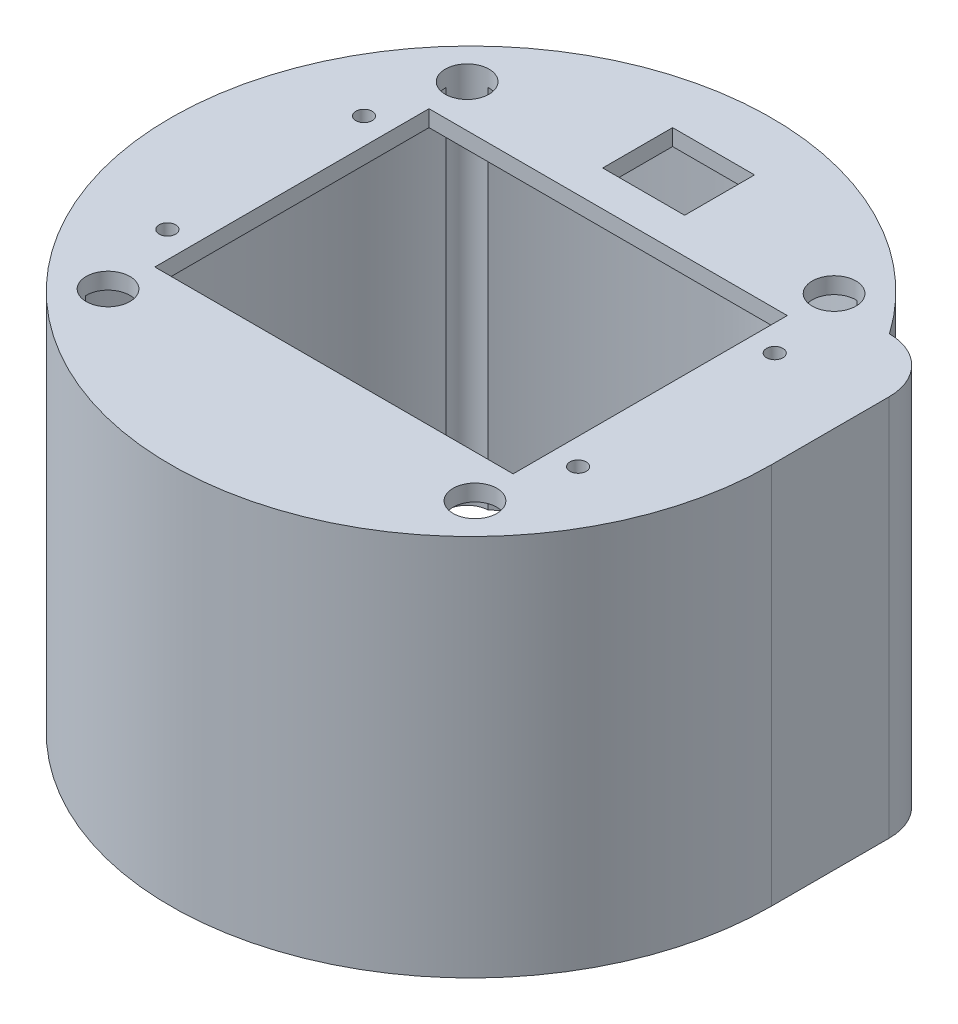
ISO-10303-21;
HEADER;
FILE_DESCRIPTION(('STEP AP214'),'2;1');
FILE_NAME('part.step','',(''),(''),'','','');
FILE_SCHEMA(('AUTOMOTIVE_DESIGN { 1 0 10303 214 1 1 1 1 }'));
ENDSEC;
DATA;
#1=APPLICATION_CONTEXT('core data for automotive mechanical design processes');
#2=APPLICATION_PROTOCOL_DEFINITION('international standard','automotive_design',2000,#1);
#3=PRODUCT_CONTEXT('',#1,'mechanical');
#4=PRODUCT('Part','Part','',(#3));
#5=PRODUCT_RELATED_PRODUCT_CATEGORY('part','',(#4));
#6=PRODUCT_DEFINITION_FORMATION('','',#4);
#7=PRODUCT_DEFINITION_CONTEXT('part definition',#1,'design');
#8=PRODUCT_DEFINITION('design','',#6,#7);
#9=PRODUCT_DEFINITION_SHAPE('','',#8);
#10=(LENGTH_UNIT() NAMED_UNIT(*) SI_UNIT(.MILLI.,.METRE.));
#11=(NAMED_UNIT(*) PLANE_ANGLE_UNIT() SI_UNIT($,.RADIAN.));
#12=(NAMED_UNIT(*) SI_UNIT($,.STERADIAN.) SOLID_ANGLE_UNIT());
#13=UNCERTAINTY_MEASURE_WITH_UNIT(LENGTH_MEASURE(1.E-05),#10,'distance_accuracy_value','');
#14=(GEOMETRIC_REPRESENTATION_CONTEXT(3) GLOBAL_UNCERTAINTY_ASSIGNED_CONTEXT((#13)) GLOBAL_UNIT_ASSIGNED_CONTEXT((#10,
#11,#12)) REPRESENTATION_CONTEXT('',''));
#15=CARTESIAN_POINT('',(0.,0.,0.));
#16=DIRECTION('',(0.,0.,1.));
#17=DIRECTION('',(1.,0.,0.));
#18=AXIS2_PLACEMENT_3D('',#15,#16,#17);
#19=CARTESIAN_POINT('',(0.,70.,0.));
#20=DIRECTION('',(0.,-1.,0.));
#21=DIRECTION('',(0.,0.,-1.));
#22=AXIS2_PLACEMENT_3D('',#19,#20,#21);
#23=CYLINDRICAL_SURFACE('',#22,55.);
#24=DIRECTION('',(0.,-1.,0.));
#25=VECTOR('',#24,1.);
#26=CARTESIAN_POINT('',(55.,101.530905994305,-2.09390455113722E-13));
#27=LINE('',#26,#25);
#28=CARTESIAN_POINT('',(55.,70.,-2.09390455113722E-13));
#29=VERTEX_POINT('',#28);
#30=CARTESIAN_POINT('',(55.,0.,-2.09390455113722E-13));
#31=VERTEX_POINT('',#30);
#32=EDGE_CURVE('E233',#29,#31,#27,.T.);
#33=ORIENTED_EDGE('',*,*,#32,.F.);
#34=CARTESIAN_POINT('',(0.,70.,0.));
#35=DIRECTION('',(0.,1.,0.));
#36=DIRECTION('',(0.,0.,1.));
#37=AXIS2_PLACEMENT_3D('',#34,#35,#36);
#38=CIRCLE('',#37,55.);
#39=CARTESIAN_POINT('',(45.0533624358946,70.,-31.5467039993074));
#40=VERTEX_POINT('',#39);
#41=EDGE_CURVE('E357',#40,#29,#38,.T.);
#42=ORIENTED_EDGE('',*,*,#41,.F.);
#43=DIRECTION('',(0.,-1.,0.));
#44=VECTOR('',#43,1.);
#45=CARTESIAN_POINT('',(45.0533624358946,101.530905994305,-31.5467039993074));
#46=LINE('',#45,#44);
#47=CARTESIAN_POINT('',(45.0533624358946,0.,-31.5467039993074));
#48=VERTEX_POINT('',#47);
#49=EDGE_CURVE('E240',#40,#48,#46,.T.);
#50=ORIENTED_EDGE('',*,*,#49,.T.);
#51=CARTESIAN_POINT('',(0.,0.,0.));
#52=DIRECTION('',(0.,1.,0.));
#53=DIRECTION('',(0.,0.,1.));
#54=AXIS2_PLACEMENT_3D('',#51,#52,#53);
#55=CIRCLE('',#54,55.);
#56=EDGE_CURVE('E350',#48,#31,#55,.T.);
#57=ORIENTED_EDGE('',*,*,#56,.T.);
#58=EDGE_LOOP('',(#33,#42,#50,#57));
#59=FACE_BOUND('',#58,.T.);
#60=ADVANCED_FACE('F34',(#59),#23,.T.);
#61=CARTESIAN_POINT('',(0.,67.,0.));
#62=DIRECTION('',(0.,-1.,0.));
#63=DIRECTION('',(0.,0.,-1.));
#64=AXIS2_PLACEMENT_3D('',#61,#62,#63);
#65=PLANE('',#64);
#66=DIRECTION('',(0.,0.,-1.));
#67=VECTOR('',#66,1.);
#68=CARTESIAN_POINT('',(-7.49999999999999,67.,0.));
#69=LINE('',#68,#67);
#70=CARTESIAN_POINT('',(-7.5,67.,-31.6));
#71=VERTEX_POINT('',#70);
#72=CARTESIAN_POINT('',(-7.5,67.,-44.4));
#73=VERTEX_POINT('',#72);
#74=EDGE_CURVE('E221',#71,#73,#69,.T.);
#75=ORIENTED_EDGE('',*,*,#74,.F.);
#76=DIRECTION('',(-1.,0.,0.));
#77=VECTOR('',#76,1.);
#78=CARTESIAN_POINT('',(0.,67.,-31.6));
#79=LINE('',#78,#77);
#80=CARTESIAN_POINT('',(7.5,67.,-31.6));
#81=VERTEX_POINT('',#80);
#82=EDGE_CURVE('E214',#81,#71,#79,.T.);
#83=ORIENTED_EDGE('',*,*,#82,.F.);
#84=DIRECTION('',(0.,0.,1.));
#85=VECTOR('',#84,1.);
#86=CARTESIAN_POINT('',(7.50000000000001,67.,0.));
#87=LINE('',#86,#85);
#88=CARTESIAN_POINT('',(7.5,67.,-44.4));
#89=VERTEX_POINT('',#88);
#90=EDGE_CURVE('E194',#89,#81,#87,.T.);
#91=ORIENTED_EDGE('',*,*,#90,.F.);
#92=DIRECTION('',(1.,0.,0.));
#93=VECTOR('',#92,1.);
#94=CARTESIAN_POINT('',(0.,67.,-44.4));
#95=LINE('',#94,#93);
#96=EDGE_CURVE('E219',#73,#89,#95,.T.);
#97=ORIENTED_EDGE('',*,*,#96,.F.);
#98=EDGE_LOOP('',(#75,#83,#91,#97));
#99=FACE_BOUND('',#98,.T.);
#100=CARTESIAN_POINT('',(-37.6,67.,18.));
#101=DIRECTION('',(0.,-1.,0.));
#102=DIRECTION('',(0.,0.,-1.));
#103=AXIS2_PLACEMENT_3D('',#100,#101,#102);
#104=CIRCLE('',#103,1.5);
#105=CARTESIAN_POINT('',(-37.6,67.,16.5));
#106=VERTEX_POINT('',#105);
#107=EDGE_CURVE('E265',#106,#106,#104,.T.);
#108=ORIENTED_EDGE('',*,*,#107,.F.);
#109=EDGE_LOOP('',(#108));
#110=FACE_BOUND('',#109,.T.);
#111=CARTESIAN_POINT('',(37.6,67.,-18.));
#112=DIRECTION('',(0.,-1.,0.));
#113=DIRECTION('',(0.,0.,-1.));
#114=AXIS2_PLACEMENT_3D('',#111,#112,#113);
#115=CIRCLE('',#114,1.5);
#116=CARTESIAN_POINT('',(37.6,67.,-19.5));
#117=VERTEX_POINT('',#116);
#118=EDGE_CURVE('E375',#117,#117,#115,.T.);
#119=ORIENTED_EDGE('',*,*,#118,.F.);
#120=EDGE_LOOP('',(#119));
#121=FACE_BOUND('',#120,.T.);
#122=CARTESIAN_POINT('',(37.6,67.,18.));
#123=DIRECTION('',(0.,-1.,0.));
#124=DIRECTION('',(0.,0.,-1.));
#125=AXIS2_PLACEMENT_3D('',#122,#123,#124);
#126=CIRCLE('',#125,1.5);
#127=CARTESIAN_POINT('',(37.6,67.,16.5));
#128=VERTEX_POINT('',#127);
#129=EDGE_CURVE('E255',#128,#128,#126,.T.);
#130=ORIENTED_EDGE('',*,*,#129,.F.);
#131=EDGE_LOOP('',(#130));
#132=FACE_BOUND('',#131,.T.);
#133=CARTESIAN_POINT('',(-37.6,67.,-18.));
#134=DIRECTION('',(0.,-1.,0.));
#135=DIRECTION('',(0.,0.,-1.));
#136=AXIS2_PLACEMENT_3D('',#133,#134,#135);
#137=CIRCLE('',#136,1.5);
#138=CARTESIAN_POINT('',(-37.6,67.,-19.5));
#139=VERTEX_POINT('',#138);
#140=EDGE_CURVE('E264',#139,#139,#137,.T.);
#141=ORIENTED_EDGE('',*,*,#140,.F.);
#142=EDGE_LOOP('',(#141));
#143=FACE_BOUND('',#142,.T.);
#144=DIRECTION('',(0.,0.,1.));
#145=VECTOR('',#144,1.);
#146=CARTESIAN_POINT('',(32.8,67.,-25.1));
#147=LINE('',#146,#145);
#148=CARTESIAN_POINT('',(32.8,67.,-25.1));
#149=VERTEX_POINT('',#148);
#150=CARTESIAN_POINT('',(32.8,67.,25.1));
#151=VERTEX_POINT('',#150);
#152=EDGE_CURVE('E314',#149,#151,#147,.T.);
#153=ORIENTED_EDGE('',*,*,#152,.F.);
#154=DIRECTION('',(1.,0.,0.));
#155=VECTOR('',#154,1.);
#156=CARTESIAN_POINT('',(-32.8,67.,-25.1));
#157=LINE('',#156,#155);
#158=CARTESIAN_POINT('',(-32.8,67.,-25.1));
#159=VERTEX_POINT('',#158);
#160=EDGE_CURVE('E319',#159,#149,#157,.T.);
#161=ORIENTED_EDGE('',*,*,#160,.F.);
#162=DIRECTION('',(0.,0.,-1.));
#163=VECTOR('',#162,1.);
#164=CARTESIAN_POINT('',(-32.8,67.,-25.1));
#165=LINE('',#164,#163);
#166=CARTESIAN_POINT('',(-32.8,67.,25.1));
#167=VERTEX_POINT('',#166);
#168=EDGE_CURVE('E333',#167,#159,#165,.T.);
#169=ORIENTED_EDGE('',*,*,#168,.F.);
#170=DIRECTION('',(-1.,0.,0.));
#171=VECTOR('',#170,1.);
#172=CARTESIAN_POINT('',(-32.8,67.,25.1));
#173=LINE('',#172,#171);
#174=EDGE_CURVE('E330',#151,#167,#173,.T.);
#175=ORIENTED_EDGE('',*,*,#174,.F.);
#176=EDGE_LOOP('',(#153,#161,#169,#175));
#177=FACE_BOUND('',#176,.T.);
#178=DIRECTION('',(-1.,0.,0.));
#179=VECTOR('',#178,1.);
#180=CARTESIAN_POINT('',(50.,67.,-28.6788218175522));
#181=LINE('',#180,#179);
#182=CARTESIAN_POINT('',(48.,67.,-28.6788218175522));
#183=VERTEX_POINT('',#182);
#184=CARTESIAN_POINT('',(40.9576022144497,67.,-28.6788218175522));
#185=VERTEX_POINT('',#184);
#186=EDGE_CURVE('E236',#183,#185,#181,.T.);
#187=ORIENTED_EDGE('',*,*,#186,.F.);
#188=CARTESIAN_POINT('',(48.,67.,-26.6788218175522));
#189=DIRECTION('',(0.,-1.,0.));
#190=DIRECTION('',(0.,0.,-1.));
#191=AXIS2_PLACEMENT_3D('',#188,#189,#190);
#192=CIRCLE('',#191,2.);
#193=CARTESIAN_POINT('',(50.,67.,-26.6788218175522));
#194=VERTEX_POINT('',#193);
#195=EDGE_CURVE('E389',#183,#194,#192,.T.);
#196=ORIENTED_EDGE('',*,*,#195,.T.);
#197=DIRECTION('',(0.,0.,-1.));
#198=VECTOR('',#197,1.);
#199=CARTESIAN_POINT('',(50.,67.,-1.95217276306281E-13));
#200=LINE('',#199,#198);
#201=CARTESIAN_POINT('',(50.,67.,-1.95217276306281E-13));
#202=VERTEX_POINT('',#201);
#203=EDGE_CURVE('E226',#202,#194,#200,.T.);
#204=ORIENTED_EDGE('',*,*,#203,.F.);
#205=CARTESIAN_POINT('',(0.,67.,0.));
#206=DIRECTION('',(0.,-1.,0.));
#207=DIRECTION('',(0.,0.,-1.));
#208=AXIS2_PLACEMENT_3D('',#205,#206,#207);
#209=CIRCLE('',#208,50.);
#210=CARTESIAN_POINT('',(37.590562846943,67.,32.9689184664894));
#211=VERTEX_POINT('',#210);
#212=EDGE_CURVE('E352',#202,#211,#209,.T.);
#213=ORIENTED_EDGE('',*,*,#212,.T.);
#214=CARTESIAN_POINT('',(33.5917270558466,67.,32.8724181253145));
#215=DIRECTION('',(0.,-1.,0.));
#216=DIRECTION('',(0.,0.,-1.));
#217=AXIS2_PLACEMENT_3D('',#214,#215,#216);
#218=CIRCLE('',#217,4.00000000000001);
#219=CARTESIAN_POINT('',(33.7747495446767,67.,36.8682287775581));
#220=VERTEX_POINT('',#219);
#221=EDGE_CURVE('E360',#220,#211,#218,.T.);
#222=ORIENTED_EDGE('',*,*,#221,.F.);
#223=CARTESIAN_POINT('',(-33.7747495446767,67.,36.8682287775581));
#224=VERTEX_POINT('',#223);
#225=EDGE_CURVE('E347',#220,#224,#209,.T.);
#226=ORIENTED_EDGE('',*,*,#225,.T.);
#227=CARTESIAN_POINT('',(-33.5917270558466,67.,32.8724181253145));
#228=DIRECTION('',(0.,-1.,0.));
#229=DIRECTION('',(0.,0.,-1.));
#230=AXIS2_PLACEMENT_3D('',#227,#228,#229);
#231=CIRCLE('',#230,4.);
#232=CARTESIAN_POINT('',(-37.590562846943,67.,32.9689184664894));
#233=VERTEX_POINT('',#232);
#234=EDGE_CURVE('E368',#233,#224,#231,.T.);
#235=ORIENTED_EDGE('',*,*,#234,.F.);
#236=CARTESIAN_POINT('',(-37.590562846943,67.,-32.9689184664894));
#237=VERTEX_POINT('',#236);
#238=EDGE_CURVE('E351',#233,#237,#209,.T.);
#239=ORIENTED_EDGE('',*,*,#238,.T.);
#240=CARTESIAN_POINT('',(-33.5917270558466,67.,-32.8724181253145));
#241=DIRECTION('',(0.,-1.,0.));
#242=DIRECTION('',(0.,0.,-1.));
#243=AXIS2_PLACEMENT_3D('',#240,#241,#242);
#244=CIRCLE('',#243,4.);
#245=CARTESIAN_POINT('',(-33.7747495446767,67.,-36.8682287775581));
#246=VERTEX_POINT('',#245);
#247=EDGE_CURVE('E366',#246,#237,#244,.T.);
#248=ORIENTED_EDGE('',*,*,#247,.F.);
#249=CARTESIAN_POINT('',(33.7747495446767,67.,-36.8682287775581));
#250=VERTEX_POINT('',#249);
#251=EDGE_CURVE('E414',#246,#250,#209,.T.);
#252=ORIENTED_EDGE('',*,*,#251,.T.);
#253=CARTESIAN_POINT('',(33.5917270558466,67.,-32.8724181253145));
#254=DIRECTION('',(0.,-1.,0.));
#255=DIRECTION('',(0.,0.,-1.));
#256=AXIS2_PLACEMENT_3D('',#253,#254,#255);
#257=CIRCLE('',#256,4.);
#258=CARTESIAN_POINT('',(37.590562846943,67.,-32.9689184664895));
#259=VERTEX_POINT('',#258);
#260=EDGE_CURVE('E364',#259,#250,#257,.T.);
#261=ORIENTED_EDGE('',*,*,#260,.F.);
#262=EDGE_CURVE('E411',#259,#185,#209,.T.);
#263=ORIENTED_EDGE('',*,*,#262,.T.);
#264=EDGE_LOOP('',(#187,#196,#204,#213,#222,#226,#235,#239,#248,#252,#261,#263));
#265=FACE_BOUND('',#264,.T.);
#266=ADVANCED_FACE('F408',(#99,#110,#121,#132,#143,#177,#265),#65,.T.);
#267=CARTESIAN_POINT('',(0.,67.,0.));
#268=DIRECTION('',(0.,-1.,0.));
#269=DIRECTION('',(0.,0.,-1.));
#270=AXIS2_PLACEMENT_3D('',#267,#268,#269);
#271=CYLINDRICAL_SURFACE('',#270,50.);
#272=CARTESIAN_POINT('',(0.,0.,0.));
#273=DIRECTION('',(0.,-1.,0.));
#274=DIRECTION('',(0.,0.,-1.));
#275=AXIS2_PLACEMENT_3D('',#272,#273,#274);
#276=CIRCLE('',#275,50.);
#277=CARTESIAN_POINT('',(37.5905628469429,0.,-32.9689184664896));
#278=VERTEX_POINT('',#277);
#279=CARTESIAN_POINT('',(40.9576022144497,0.,-28.6788218175522));
#280=VERTEX_POINT('',#279);
#281=EDGE_CURVE('E423',#278,#280,#276,.T.);
#282=ORIENTED_EDGE('',*,*,#281,.T.);
#283=DIRECTION('',(0.,-1.,0.));
#284=VECTOR('',#283,1.);
#285=CARTESIAN_POINT('',(40.9576022144497,101.530905994305,-28.6788218175522));
#286=LINE('',#285,#284);
#287=EDGE_CURVE('E244',#185,#280,#286,.T.);
#288=ORIENTED_EDGE('',*,*,#287,.F.);
#289=ORIENTED_EDGE('',*,*,#262,.F.);
#290=DIRECTION('',(0.,1.,0.));
#291=VECTOR('',#290,1.);
#292=CARTESIAN_POINT('',(37.5905628469429,35.,-32.9689184664895));
#293=LINE('',#292,#291);
#294=EDGE_CURVE('E287',#259,#278,#293,.F.);
#295=ORIENTED_EDGE('',*,*,#294,.T.);
#296=EDGE_LOOP('',(#282,#288,#289,#295));
#297=FACE_BOUND('',#296,.T.);
#298=ADVANCED_FACE('F449',(#297),#271,.F.);
#299=ORIENTED_EDGE('',*,*,#238,.F.);
#300=DIRECTION('',(0.,1.,0.));
#301=VECTOR('',#300,1.);
#302=CARTESIAN_POINT('',(-37.5905628469429,35.,32.9689184664894));
#303=LINE('',#302,#301);
#304=CARTESIAN_POINT('',(-37.5905628469429,0.,32.9689184664895));
#305=VERTEX_POINT('',#304);
#306=EDGE_CURVE('E299',#233,#305,#303,.F.);
#307=ORIENTED_EDGE('',*,*,#306,.T.);
#308=CARTESIAN_POINT('',(-37.5905628469429,0.,-32.9689184664895));
#309=VERTEX_POINT('',#308);
#310=EDGE_CURVE('E356',#305,#309,#276,.T.);
#311=ORIENTED_EDGE('',*,*,#310,.T.);
#312=DIRECTION('',(0.,1.,0.));
#313=VECTOR('',#312,1.);
#314=CARTESIAN_POINT('',(-37.5905628469429,35.,-32.9689184664894));
#315=LINE('',#314,#313);
#316=EDGE_CURVE('E290',#309,#237,#315,.T.);
#317=ORIENTED_EDGE('',*,*,#316,.T.);
#318=EDGE_LOOP('',(#299,#307,#311,#317));
#319=FACE_BOUND('',#318,.T.);
#320=ADVANCED_FACE('F433',(#319),#271,.F.);
#321=ORIENTED_EDGE('',*,*,#251,.F.);
#322=DIRECTION('',(0.,1.,0.));
#323=VECTOR('',#322,1.);
#324=CARTESIAN_POINT('',(-33.7747495446767,35.,-36.868228777558));
#325=LINE('',#324,#323);
#326=CARTESIAN_POINT('',(-33.7747495446768,0.,-36.868228777558));
#327=VERTEX_POINT('',#326);
#328=EDGE_CURVE('E293',#246,#327,#325,.F.);
#329=ORIENTED_EDGE('',*,*,#328,.T.);
#330=CARTESIAN_POINT('',(33.7747495446768,0.,-36.868228777558));
#331=VERTEX_POINT('',#330);
#332=EDGE_CURVE('E424',#327,#331,#276,.T.);
#333=ORIENTED_EDGE('',*,*,#332,.T.);
#334=DIRECTION('',(0.,1.,0.));
#335=VECTOR('',#334,1.);
#336=CARTESIAN_POINT('',(33.7747495446767,35.,-36.868228777558));
#337=LINE('',#336,#335);
#338=EDGE_CURVE('E269',#331,#250,#337,.T.);
#339=ORIENTED_EDGE('',*,*,#338,.T.);
#340=EDGE_LOOP('',(#321,#329,#333,#339));
#341=FACE_BOUND('',#340,.T.);
#342=ADVANCED_FACE('F440',(#341),#271,.F.);
#343=ORIENTED_EDGE('',*,*,#212,.F.);
#344=DIRECTION('',(0.,-1.,0.));
#345=VECTOR('',#344,1.);
#346=CARTESIAN_POINT('',(50.,101.530905994305,-1.95217276306281E-13));
#347=LINE('',#346,#345);
#348=CARTESIAN_POINT('',(50.,0.,-1.95217276306281E-13));
#349=VERTEX_POINT('',#348);
#350=EDGE_CURVE('E247',#202,#349,#347,.T.);
#351=ORIENTED_EDGE('',*,*,#350,.T.);
#352=CARTESIAN_POINT('',(37.5905628469429,0.,32.9689184664895));
#353=VERTEX_POINT('',#352);
#354=EDGE_CURVE('E340',#349,#353,#276,.T.);
#355=ORIENTED_EDGE('',*,*,#354,.T.);
#356=DIRECTION('',(0.,1.,0.));
#357=VECTOR('',#356,1.);
#358=CARTESIAN_POINT('',(37.5905628469429,35.,32.9689184664894));
#359=LINE('',#358,#357);
#360=EDGE_CURVE('E306',#353,#211,#359,.T.);
#361=ORIENTED_EDGE('',*,*,#360,.T.);
#362=EDGE_LOOP('',(#343,#351,#355,#361));
#363=FACE_BOUND('',#362,.T.);
#364=ADVANCED_FACE('F422',(#363),#271,.F.);
#365=CARTESIAN_POINT('',(0.,70.,0.));
#366=DIRECTION('',(0.,1.,0.));
#367=DIRECTION('',(0.,0.,1.));
#368=AXIS2_PLACEMENT_3D('',#365,#366,#367);
#369=PLANE('',#368);
#370=DIRECTION('',(0.,0.,1.));
#371=VECTOR('',#370,1.);
#372=CARTESIAN_POINT('',(-7.5,70.,-44.4));
#373=LINE('',#372,#371);
#374=CARTESIAN_POINT('',(-7.5,70.,-44.4));
#375=VERTEX_POINT('',#374);
#376=CARTESIAN_POINT('',(-7.5,70.,-31.6));
#377=VERTEX_POINT('',#376);
#378=EDGE_CURVE('E57',#375,#377,#373,.T.);
#379=ORIENTED_EDGE('',*,*,#378,.F.);
#380=DIRECTION('',(-1.,0.,0.));
#381=VECTOR('',#380,1.);
#382=CARTESIAN_POINT('',(7.5,70.,-44.4));
#383=LINE('',#382,#381);
#384=CARTESIAN_POINT('',(7.5,70.,-44.4));
#385=VERTEX_POINT('',#384);
#386=EDGE_CURVE('E207',#385,#375,#383,.T.);
#387=ORIENTED_EDGE('',*,*,#386,.F.);
#388=DIRECTION('',(0.,0.,-1.));
#389=VECTOR('',#388,1.);
#390=CARTESIAN_POINT('',(7.5,70.,-44.4));
#391=LINE('',#390,#389);
#392=CARTESIAN_POINT('',(7.5,70.,-31.6));
#393=VERTEX_POINT('',#392);
#394=EDGE_CURVE('E191',#393,#385,#391,.T.);
#395=ORIENTED_EDGE('',*,*,#394,.F.);
#396=DIRECTION('',(1.,0.,0.));
#397=VECTOR('',#396,1.);
#398=CARTESIAN_POINT('',(7.5,70.,-31.6));
#399=LINE('',#398,#397);
#400=EDGE_CURVE('E200',#377,#393,#399,.T.);
#401=ORIENTED_EDGE('',*,*,#400,.F.);
#402=EDGE_LOOP('',(#379,#387,#395,#401));
#403=FACE_BOUND('',#402,.T.);
#404=CARTESIAN_POINT('',(-37.6,70.,18.));
#405=DIRECTION('',(0.,1.,0.));
#406=DIRECTION('',(0.,0.,1.));
#407=AXIS2_PLACEMENT_3D('',#404,#405,#406);
#408=CIRCLE('',#407,1.5);
#409=CARTESIAN_POINT('',(-37.6,70.,19.5));
#410=VERTEX_POINT('',#409);
#411=EDGE_CURVE('E252',#410,#410,#408,.T.);
#412=ORIENTED_EDGE('',*,*,#411,.F.);
#413=EDGE_LOOP('',(#412));
#414=FACE_BOUND('',#413,.T.);
#415=CARTESIAN_POINT('',(37.6,70.,-18.));
#416=DIRECTION('',(0.,1.,0.));
#417=DIRECTION('',(0.,0.,1.));
#418=AXIS2_PLACEMENT_3D('',#415,#416,#417);
#419=CIRCLE('',#418,1.5);
#420=CARTESIAN_POINT('',(37.6,70.,-16.5));
#421=VERTEX_POINT('',#420);
#422=EDGE_CURVE('E256',#421,#421,#419,.T.);
#423=ORIENTED_EDGE('',*,*,#422,.F.);
#424=EDGE_LOOP('',(#423));
#425=FACE_BOUND('',#424,.T.);
#426=CARTESIAN_POINT('',(37.6,70.,18.));
#427=DIRECTION('',(0.,1.,0.));
#428=DIRECTION('',(0.,0.,1.));
#429=AXIS2_PLACEMENT_3D('',#426,#427,#428);
#430=CIRCLE('',#429,1.5);
#431=CARTESIAN_POINT('',(37.6,70.,19.5));
#432=VERTEX_POINT('',#431);
#433=EDGE_CURVE('E243',#432,#432,#430,.T.);
#434=ORIENTED_EDGE('',*,*,#433,.F.);
#435=EDGE_LOOP('',(#434));
#436=FACE_BOUND('',#435,.T.);
#437=CARTESIAN_POINT('',(-37.6,70.,-18.));
#438=DIRECTION('',(0.,1.,0.));
#439=DIRECTION('',(0.,0.,1.));
#440=AXIS2_PLACEMENT_3D('',#437,#438,#439);
#441=CIRCLE('',#440,1.5);
#442=CARTESIAN_POINT('',(-37.6,70.,-16.5));
#443=VERTEX_POINT('',#442);
#444=EDGE_CURVE('E261',#443,#443,#441,.T.);
#445=ORIENTED_EDGE('',*,*,#444,.F.);
#446=EDGE_LOOP('',(#445));
#447=FACE_BOUND('',#446,.T.);
#448=CARTESIAN_POINT('',(-33.5917270558466,70.,32.8724181253145));
#449=DIRECTION('',(0.,1.,0.));
#450=DIRECTION('',(0.,0.,1.));
#451=AXIS2_PLACEMENT_3D('',#448,#449,#450);
#452=CIRCLE('',#451,4.);
#453=CARTESIAN_POINT('',(-33.5917270558466,70.,36.8724181253145));
#454=VERTEX_POINT('',#453);
#455=EDGE_CURVE('E270',#454,#454,#452,.T.);
#456=ORIENTED_EDGE('',*,*,#455,.F.);
#457=EDGE_LOOP('',(#456));
#458=FACE_BOUND('',#457,.T.);
#459=CARTESIAN_POINT('',(-33.5917270558466,70.,-32.8724181253145));
#460=DIRECTION('',(0.,1.,0.));
#461=DIRECTION('',(0.,0.,1.));
#462=AXIS2_PLACEMENT_3D('',#459,#460,#461);
#463=CIRCLE('',#462,4.);
#464=CARTESIAN_POINT('',(-33.5917270558466,70.,-28.8724181253145));
#465=VERTEX_POINT('',#464);
#466=EDGE_CURVE('E276',#465,#465,#463,.T.);
#467=ORIENTED_EDGE('',*,*,#466,.F.);
#468=EDGE_LOOP('',(#467));
#469=FACE_BOUND('',#468,.T.);
#470=CARTESIAN_POINT('',(33.5917270558466,70.,-32.8724181253145));
#471=DIRECTION('',(0.,1.,0.));
#472=DIRECTION('',(0.,0.,1.));
#473=AXIS2_PLACEMENT_3D('',#470,#471,#472);
#474=CIRCLE('',#473,4.);
#475=CARTESIAN_POINT('',(33.5917270558466,70.,-28.8724181253145));
#476=VERTEX_POINT('',#475);
#477=EDGE_CURVE('E282',#476,#476,#474,.T.);
#478=ORIENTED_EDGE('',*,*,#477,.F.);
#479=EDGE_LOOP('',(#478));
#480=FACE_BOUND('',#479,.T.);
#481=CARTESIAN_POINT('',(33.5917270558466,70.,32.8724181253145));
#482=DIRECTION('',(0.,1.,0.));
#483=DIRECTION('',(0.,0.,1.));
#484=AXIS2_PLACEMENT_3D('',#481,#482,#483);
#485=CIRCLE('',#484,4.00000000000001);
#486=CARTESIAN_POINT('',(33.5917270558466,70.,36.8724181253145));
#487=VERTEX_POINT('',#486);
#488=EDGE_CURVE('E302',#487,#487,#485,.T.);
#489=ORIENTED_EDGE('',*,*,#488,.F.);
#490=EDGE_LOOP('',(#489));
#491=FACE_BOUND('',#490,.T.);
#492=DIRECTION('',(0.,0.,1.));
#493=VECTOR('',#492,1.);
#494=CARTESIAN_POINT('',(32.8,70.,-25.1));
#495=LINE('',#494,#493);
#496=CARTESIAN_POINT('',(32.8,70.,-25.1));
#497=VERTEX_POINT('',#496);
#498=CARTESIAN_POINT('',(32.8,70.,25.1));
#499=VERTEX_POINT('',#498);
#500=EDGE_CURVE('E315',#497,#499,#495,.T.);
#501=ORIENTED_EDGE('',*,*,#500,.T.);
#502=DIRECTION('',(-1.,0.,0.));
#503=VECTOR('',#502,1.);
#504=CARTESIAN_POINT('',(-32.8,70.,25.1));
#505=LINE('',#504,#503);
#506=CARTESIAN_POINT('',(-32.8,70.,25.1));
#507=VERTEX_POINT('',#506);
#508=EDGE_CURVE('E318',#499,#507,#505,.T.);
#509=ORIENTED_EDGE('',*,*,#508,.T.);
#510=DIRECTION('',(0.,0.,-1.));
#511=VECTOR('',#510,1.);
#512=CARTESIAN_POINT('',(-32.8,70.,-25.1));
#513=LINE('',#512,#511);
#514=CARTESIAN_POINT('',(-32.8,70.,-25.1));
#515=VERTEX_POINT('',#514);
#516=EDGE_CURVE('E322',#507,#515,#513,.T.);
#517=ORIENTED_EDGE('',*,*,#516,.T.);
#518=DIRECTION('',(1.,0.,0.));
#519=VECTOR('',#518,1.);
#520=CARTESIAN_POINT('',(-32.8,70.,-25.1));
#521=LINE('',#520,#519);
#522=EDGE_CURVE('E325',#515,#497,#521,.T.);
#523=ORIENTED_EDGE('',*,*,#522,.T.);
#524=EDGE_LOOP('',(#501,#509,#517,#523));
#525=FACE_BOUND('',#524,.T.);
#526=DIRECTION('',(0.,0.,-1.));
#527=VECTOR('',#526,1.);
#528=CARTESIAN_POINT('',(55.,70.,-2.09390455113722E-13));
#529=LINE('',#528,#527);
#530=CARTESIAN_POINT('',(55.,70.,-21.5468463777993));
#531=VERTEX_POINT('',#530);
#532=EDGE_CURVE('E223',#29,#531,#529,.T.);
#533=ORIENTED_EDGE('',*,*,#532,.T.);
#534=CARTESIAN_POINT('',(45.,70.,-21.5468463777993));
#535=DIRECTION('',(0.,1.,0.));
#536=DIRECTION('',(0.,0.,1.));
#537=AXIS2_PLACEMENT_3D('',#534,#535,#536);
#538=CIRCLE('',#537,10.);
#539=EDGE_CURVE('E382',#531,#40,#538,.T.);
#540=ORIENTED_EDGE('',*,*,#539,.T.);
#541=ORIENTED_EDGE('',*,*,#41,.T.);
#542=EDGE_LOOP('',(#533,#540,#541));
#543=FACE_BOUND('',#542,.T.);
#544=ADVANCED_FACE('F204',(#403,#414,#425,#436,#447,#458,#469,#480,#491,#525,#543),#369,.T.);
#545=CARTESIAN_POINT('',(0.,0.,0.));
#546=DIRECTION('',(0.,1.,0.));
#547=DIRECTION('',(0.,0.,1.));
#548=AXIS2_PLACEMENT_3D('',#545,#546,#547);
#549=PLANE('',#548);
#550=ORIENTED_EDGE('',*,*,#56,.F.);
#551=CARTESIAN_POINT('',(45.,0.,-21.5468463777993));
#552=DIRECTION('',(0.,1.,0.));
#553=DIRECTION('',(0.,0.,1.));
#554=AXIS2_PLACEMENT_3D('',#551,#552,#553);
#555=CIRCLE('',#554,10.);
#556=CARTESIAN_POINT('',(55.,0.,-21.5468463777993));
#557=VERTEX_POINT('',#556);
#558=EDGE_CURVE('E384',#48,#557,#555,.F.);
#559=ORIENTED_EDGE('',*,*,#558,.T.);
#560=DIRECTION('',(0.,0.,-1.));
#561=VECTOR('',#560,1.);
#562=CARTESIAN_POINT('',(55.,0.,-2.09390455113722E-13));
#563=LINE('',#562,#561);
#564=EDGE_CURVE('E229',#31,#557,#563,.T.);
#565=ORIENTED_EDGE('',*,*,#564,.F.);
#566=EDGE_LOOP('',(#550,#559,#565));
#567=FACE_BOUND('',#566,.T.);
#568=DIRECTION('',(1.,0.,0.));
#569=VECTOR('',#568,1.);
#570=CARTESIAN_POINT('',(50.,0.,-28.6788218175522));
#571=LINE('',#570,#569);
#572=CARTESIAN_POINT('',(48.,0.,-28.6788218175522));
#573=VERTEX_POINT('',#572);
#574=EDGE_CURVE('E230',#280,#573,#571,.T.);
#575=ORIENTED_EDGE('',*,*,#574,.F.);
#576=ORIENTED_EDGE('',*,*,#281,.F.);
#577=CARTESIAN_POINT('',(33.5917270558466,0.,-32.8724181253145));
#578=DIRECTION('',(0.,1.,0.));
#579=DIRECTION('',(0.,0.,1.));
#580=AXIS2_PLACEMENT_3D('',#577,#578,#579);
#581=CIRCLE('',#580,4.);
#582=EDGE_CURVE('E279',#278,#331,#581,.T.);
#583=ORIENTED_EDGE('',*,*,#582,.T.);
#584=ORIENTED_EDGE('',*,*,#332,.F.);
#585=CARTESIAN_POINT('',(-33.5917270558466,0.,-32.8724181253145));
#586=DIRECTION('',(0.,1.,0.));
#587=DIRECTION('',(0.,0.,1.));
#588=AXIS2_PLACEMENT_3D('',#585,#586,#587);
#589=CIRCLE('',#588,4.);
#590=EDGE_CURVE('E273',#327,#309,#589,.T.);
#591=ORIENTED_EDGE('',*,*,#590,.T.);
#592=ORIENTED_EDGE('',*,*,#310,.F.);
#593=CARTESIAN_POINT('',(-33.5917270558466,0.,32.8724181253145));
#594=DIRECTION('',(0.,1.,0.));
#595=DIRECTION('',(0.,0.,1.));
#596=AXIS2_PLACEMENT_3D('',#593,#594,#595);
#597=CIRCLE('',#596,4.);
#598=CARTESIAN_POINT('',(-33.7747495446768,0.,36.868228777558));
#599=VERTEX_POINT('',#598);
#600=EDGE_CURVE('E266',#305,#599,#597,.T.);
#601=ORIENTED_EDGE('',*,*,#600,.T.);
#602=CARTESIAN_POINT('',(33.7747495446768,0.,36.868228777558));
#603=VERTEX_POINT('',#602);
#604=EDGE_CURVE('E353',#603,#599,#276,.T.);
#605=ORIENTED_EDGE('',*,*,#604,.F.);
#606=CARTESIAN_POINT('',(33.5917270558466,0.,32.8724181253145));
#607=DIRECTION('',(0.,1.,0.));
#608=DIRECTION('',(0.,0.,1.));
#609=AXIS2_PLACEMENT_3D('',#606,#607,#608);
#610=CIRCLE('',#609,4.00000000000001);
#611=EDGE_CURVE('E303',#603,#353,#610,.T.);
#612=ORIENTED_EDGE('',*,*,#611,.T.);
#613=ORIENTED_EDGE('',*,*,#354,.F.);
#614=DIRECTION('',(0.,0.,1.));
#615=VECTOR('',#614,1.);
#616=CARTESIAN_POINT('',(50.,0.,-1.95217276306281E-13));
#617=LINE('',#616,#615);
#618=CARTESIAN_POINT('',(50.,0.,-26.6788218175522));
#619=VERTEX_POINT('',#618);
#620=EDGE_CURVE('E227',#619,#349,#617,.T.);
#621=ORIENTED_EDGE('',*,*,#620,.F.);
#622=CARTESIAN_POINT('',(48.,0.,-26.6788218175522));
#623=DIRECTION('',(0.,1.,0.));
#624=DIRECTION('',(0.,0.,1.));
#625=AXIS2_PLACEMENT_3D('',#622,#623,#624);
#626=CIRCLE('',#625,2.);
#627=EDGE_CURVE('E11',#619,#573,#626,.T.);
#628=ORIENTED_EDGE('',*,*,#627,.T.);
#629=EDGE_LOOP('',(#575,#576,#583,#584,#591,#592,#601,#605,#612,#613,#621,#628));
#630=FACE_BOUND('',#629,.T.);
#631=ADVANCED_FACE('F400',(#567,#630),#549,.F.);
#632=ORIENTED_EDGE('',*,*,#604,.T.);
#633=DIRECTION('',(0.,1.,0.));
#634=VECTOR('',#633,1.);
#635=CARTESIAN_POINT('',(-33.7747495446767,35.,36.868228777558));
#636=LINE('',#635,#634);
#637=EDGE_CURVE('E296',#599,#224,#636,.T.);
#638=ORIENTED_EDGE('',*,*,#637,.T.);
#639=ORIENTED_EDGE('',*,*,#225,.F.);
#640=DIRECTION('',(0.,1.,0.));
#641=VECTOR('',#640,1.);
#642=CARTESIAN_POINT('',(33.7747495446767,35.,36.868228777558));
#643=LINE('',#642,#641);
#644=EDGE_CURVE('E311',#220,#603,#643,.F.);
#645=ORIENTED_EDGE('',*,*,#644,.T.);
#646=EDGE_LOOP('',(#632,#638,#639,#645));
#647=FACE_BOUND('',#646,.T.);
#648=ADVANCED_FACE('F445',(#647),#271,.F.);
#649=CARTESIAN_POINT('',(32.8,70.,-25.1));
#650=DIRECTION('',(1.,0.,0.));
#651=DIRECTION('',(0.,0.,-1.));
#652=AXIS2_PLACEMENT_3D('',#649,#650,#651);
#653=PLANE('',#652);
#654=ORIENTED_EDGE('',*,*,#152,.T.);
#655=DIRECTION('',(0.,-1.,0.));
#656=VECTOR('',#655,1.);
#657=CARTESIAN_POINT('',(32.8,70.,25.1));
#658=LINE('',#657,#656);
#659=EDGE_CURVE('E328',#499,#151,#658,.T.);
#660=ORIENTED_EDGE('',*,*,#659,.F.);
#661=ORIENTED_EDGE('',*,*,#500,.F.);
#662=DIRECTION('',(0.,-1.,0.));
#663=VECTOR('',#662,1.);
#664=CARTESIAN_POINT('',(32.8,70.,-25.1));
#665=LINE('',#664,#663);
#666=EDGE_CURVE('E338',#497,#149,#665,.T.);
#667=ORIENTED_EDGE('',*,*,#666,.T.);
#668=EDGE_LOOP('',(#654,#660,#661,#667));
#669=FACE_BOUND('',#668,.T.);
#670=ADVANCED_FACE('F447',(#669),#653,.F.);
#671=CARTESIAN_POINT('',(-32.8,70.,-25.1));
#672=DIRECTION('',(0.,0.,-1.));
#673=DIRECTION('',(-1.,0.,0.));
#674=AXIS2_PLACEMENT_3D('',#671,#672,#673);
#675=PLANE('',#674);
#676=ORIENTED_EDGE('',*,*,#160,.T.);
#677=ORIENTED_EDGE('',*,*,#666,.F.);
#678=ORIENTED_EDGE('',*,*,#522,.F.);
#679=DIRECTION('',(0.,-1.,0.));
#680=VECTOR('',#679,1.);
#681=CARTESIAN_POINT('',(-32.8,70.,-25.1));
#682=LINE('',#681,#680);
#683=EDGE_CURVE('E341',#515,#159,#682,.T.);
#684=ORIENTED_EDGE('',*,*,#683,.T.);
#685=EDGE_LOOP('',(#676,#677,#678,#684));
#686=FACE_BOUND('',#685,.T.);
#687=ADVANCED_FACE('F454',(#686),#675,.F.);
#688=CARTESIAN_POINT('',(-32.8,70.,-25.1));
#689=DIRECTION('',(-1.,0.,0.));
#690=DIRECTION('',(0.,0.,1.));
#691=AXIS2_PLACEMENT_3D('',#688,#689,#690);
#692=PLANE('',#691);
#693=ORIENTED_EDGE('',*,*,#168,.T.);
#694=ORIENTED_EDGE('',*,*,#683,.F.);
#695=ORIENTED_EDGE('',*,*,#516,.F.);
#696=DIRECTION('',(0.,-1.,0.));
#697=VECTOR('',#696,1.);
#698=CARTESIAN_POINT('',(-32.8,70.,25.1));
#699=LINE('',#698,#697);
#700=EDGE_CURVE('E343',#507,#167,#699,.T.);
#701=ORIENTED_EDGE('',*,*,#700,.T.);
#702=EDGE_LOOP('',(#693,#694,#695,#701));
#703=FACE_BOUND('',#702,.T.);
#704=ADVANCED_FACE('F652',(#703),#692,.F.);
#705=CARTESIAN_POINT('',(-32.8,70.,25.1));
#706=DIRECTION('',(0.,0.,1.));
#707=DIRECTION('',(1.,0.,0.));
#708=AXIS2_PLACEMENT_3D('',#705,#706,#707);
#709=PLANE('',#708);
#710=ORIENTED_EDGE('',*,*,#174,.T.);
#711=ORIENTED_EDGE('',*,*,#700,.F.);
#712=ORIENTED_EDGE('',*,*,#508,.F.);
#713=ORIENTED_EDGE('',*,*,#659,.T.);
#714=EDGE_LOOP('',(#710,#711,#712,#713));
#715=FACE_BOUND('',#714,.T.);
#716=ADVANCED_FACE('F571',(#715),#709,.F.);
#717=CARTESIAN_POINT('',(33.5917270558466,0.,32.8724181253145));
#718=DIRECTION('',(0.,1.,0.));
#719=DIRECTION('',(0.,0.,1.));
#720=AXIS2_PLACEMENT_3D('',#717,#718,#719);
#721=CYLINDRICAL_SURFACE('',#720,4.00000000000001);
#722=ORIENTED_EDGE('',*,*,#488,.T.);
#723=EDGE_LOOP('',(#722));
#724=FACE_BOUND('',#723,.T.);
#725=ORIENTED_EDGE('',*,*,#221,.T.);
#726=ORIENTED_EDGE('',*,*,#360,.F.);
#727=ORIENTED_EDGE('',*,*,#611,.F.);
#728=ORIENTED_EDGE('',*,*,#644,.F.);
#729=EDGE_LOOP('',(#725,#726,#727,#728));
#730=FACE_BOUND('',#729,.T.);
#731=ADVANCED_FACE('F421',(#724,#730),#721,.F.);
#732=CARTESIAN_POINT('',(33.5917270558466,0.,-32.8724181253145));
#733=DIRECTION('',(0.,1.,0.));
#734=DIRECTION('',(0.,0.,1.));
#735=AXIS2_PLACEMENT_3D('',#732,#733,#734);
#736=CYLINDRICAL_SURFACE('',#735,4.);
#737=ORIENTED_EDGE('',*,*,#477,.T.);
#738=EDGE_LOOP('',(#737));
#739=FACE_BOUND('',#738,.T.);
#740=ORIENTED_EDGE('',*,*,#260,.T.);
#741=ORIENTED_EDGE('',*,*,#338,.F.);
#742=ORIENTED_EDGE('',*,*,#582,.F.);
#743=ORIENTED_EDGE('',*,*,#294,.F.);
#744=EDGE_LOOP('',(#740,#741,#742,#743));
#745=FACE_BOUND('',#744,.T.);
#746=ADVANCED_FACE('F570',(#739,#745),#736,.F.);
#747=CARTESIAN_POINT('',(-33.5917270558466,0.,-32.8724181253145));
#748=DIRECTION('',(0.,1.,0.));
#749=DIRECTION('',(0.,0.,1.));
#750=AXIS2_PLACEMENT_3D('',#747,#748,#749);
#751=CYLINDRICAL_SURFACE('',#750,4.);
#752=ORIENTED_EDGE('',*,*,#466,.T.);
#753=EDGE_LOOP('',(#752));
#754=FACE_BOUND('',#753,.T.);
#755=ORIENTED_EDGE('',*,*,#247,.T.);
#756=ORIENTED_EDGE('',*,*,#316,.F.);
#757=ORIENTED_EDGE('',*,*,#590,.F.);
#758=ORIENTED_EDGE('',*,*,#328,.F.);
#759=EDGE_LOOP('',(#755,#756,#757,#758));
#760=FACE_BOUND('',#759,.T.);
#761=ADVANCED_FACE('F437',(#754,#760),#751,.F.);
#762=CARTESIAN_POINT('',(-33.5917270558466,0.,32.8724181253145));
#763=DIRECTION('',(0.,1.,0.));
#764=DIRECTION('',(0.,0.,1.));
#765=AXIS2_PLACEMENT_3D('',#762,#763,#764);
#766=CYLINDRICAL_SURFACE('',#765,4.);
#767=ORIENTED_EDGE('',*,*,#455,.T.);
#768=EDGE_LOOP('',(#767));
#769=FACE_BOUND('',#768,.T.);
#770=ORIENTED_EDGE('',*,*,#234,.T.);
#771=ORIENTED_EDGE('',*,*,#637,.F.);
#772=ORIENTED_EDGE('',*,*,#600,.F.);
#773=ORIENTED_EDGE('',*,*,#306,.F.);
#774=EDGE_LOOP('',(#770,#771,#772,#773));
#775=FACE_BOUND('',#774,.T.);
#776=ADVANCED_FACE('F443',(#769,#775),#766,.F.);
#777=CARTESIAN_POINT('',(-37.6,60.,-18.));
#778=DIRECTION('',(0.,1.,0.));
#779=DIRECTION('',(0.,0.,1.));
#780=AXIS2_PLACEMENT_3D('',#777,#778,#779);
#781=CYLINDRICAL_SURFACE('',#780,1.5);
#782=ORIENTED_EDGE('',*,*,#140,.T.);
#783=EDGE_LOOP('',(#782));
#784=FACE_BOUND('',#783,.T.);
#785=ORIENTED_EDGE('',*,*,#444,.T.);
#786=EDGE_LOOP('',(#785));
#787=FACE_BOUND('',#786,.T.);
#788=ADVANCED_FACE('F600',(#784,#787),#781,.F.);
#789=CARTESIAN_POINT('',(37.6,60.,18.));
#790=DIRECTION('',(0.,1.,0.));
#791=DIRECTION('',(0.,0.,1.));
#792=AXIS2_PLACEMENT_3D('',#789,#790,#791);
#793=CYLINDRICAL_SURFACE('',#792,1.5);
#794=ORIENTED_EDGE('',*,*,#129,.T.);
#795=EDGE_LOOP('',(#794));
#796=FACE_BOUND('',#795,.T.);
#797=ORIENTED_EDGE('',*,*,#433,.T.);
#798=EDGE_LOOP('',(#797));
#799=FACE_BOUND('',#798,.T.);
#800=ADVANCED_FACE('F610',(#796,#799),#793,.F.);
#801=CARTESIAN_POINT('',(37.6,60.,-18.));
#802=DIRECTION('',(0.,1.,0.));
#803=DIRECTION('',(0.,0.,1.));
#804=AXIS2_PLACEMENT_3D('',#801,#802,#803);
#805=CYLINDRICAL_SURFACE('',#804,1.5);
#806=ORIENTED_EDGE('',*,*,#118,.T.);
#807=EDGE_LOOP('',(#806));
#808=FACE_BOUND('',#807,.T.);
#809=ORIENTED_EDGE('',*,*,#422,.T.);
#810=EDGE_LOOP('',(#809));
#811=FACE_BOUND('',#810,.T.);
#812=ADVANCED_FACE('F620',(#808,#811),#805,.F.);
#813=CARTESIAN_POINT('',(-37.6,60.,18.));
#814=DIRECTION('',(0.,1.,0.));
#815=DIRECTION('',(0.,0.,1.));
#816=AXIS2_PLACEMENT_3D('',#813,#814,#815);
#817=CYLINDRICAL_SURFACE('',#816,1.5);
#818=ORIENTED_EDGE('',*,*,#107,.T.);
#819=EDGE_LOOP('',(#818));
#820=FACE_BOUND('',#819,.T.);
#821=ORIENTED_EDGE('',*,*,#411,.T.);
#822=EDGE_LOOP('',(#821));
#823=FACE_BOUND('',#822,.T.);
#824=ADVANCED_FACE('F514',(#820,#823),#817,.F.);
#825=CARTESIAN_POINT('',(50.,-34.5309059943051,-28.6788218175522));
#826=DIRECTION('',(0.,0.,-1.));
#827=DIRECTION('',(-1.,0.,0.));
#828=AXIS2_PLACEMENT_3D('',#825,#826,#827);
#829=PLANE('',#828);
#830=ORIENTED_EDGE('',*,*,#574,.T.);
#831=DIRECTION('',(0.,1.,0.));
#832=VECTOR('',#831,1.);
#833=CARTESIAN_POINT('',(48.,67.,-28.6788218175522));
#834=LINE('',#833,#832);
#835=EDGE_CURVE('E386',#573,#183,#834,.T.);
#836=ORIENTED_EDGE('',*,*,#835,.T.);
#837=ORIENTED_EDGE('',*,*,#186,.T.);
#838=ORIENTED_EDGE('',*,*,#287,.T.);
#839=EDGE_LOOP('',(#830,#836,#837,#838));
#840=FACE_BOUND('',#839,.T.);
#841=ADVANCED_FACE('F404',(#840),#829,.F.);
#842=CARTESIAN_POINT('',(50.,-34.5309059943051,-1.95217276306281E-13));
#843=DIRECTION('',(1.,0.,0.));
#844=DIRECTION('',(0.,0.,-1.));
#845=AXIS2_PLACEMENT_3D('',#842,#843,#844);
#846=PLANE('',#845);
#847=ORIENTED_EDGE('',*,*,#203,.T.);
#848=DIRECTION('',(0.,1.,0.));
#849=VECTOR('',#848,1.);
#850=CARTESIAN_POINT('',(50.,0.,-26.6788218175522));
#851=LINE('',#850,#849);
#852=EDGE_CURVE('E42',#194,#619,#851,.F.);
#853=ORIENTED_EDGE('',*,*,#852,.T.);
#854=ORIENTED_EDGE('',*,*,#620,.T.);
#855=ORIENTED_EDGE('',*,*,#350,.F.);
#856=EDGE_LOOP('',(#847,#853,#854,#855));
#857=FACE_BOUND('',#856,.T.);
#858=ADVANCED_FACE('F393',(#857),#846,.F.);
#859=CARTESIAN_POINT('',(55.,-34.5309059943051,-2.09390455113722E-13));
#860=DIRECTION('',(-1.,0.,0.));
#861=DIRECTION('',(0.,0.,1.));
#862=AXIS2_PLACEMENT_3D('',#859,#860,#861);
#863=PLANE('',#862);
#864=ORIENTED_EDGE('',*,*,#564,.T.);
#865=DIRECTION('',(0.,-1.,0.));
#866=VECTOR('',#865,1.);
#867=CARTESIAN_POINT('',(55.,-34.5309059943051,-21.5468463777993));
#868=LINE('',#867,#866);
#869=EDGE_CURVE('E370',#557,#531,#868,.F.);
#870=ORIENTED_EDGE('',*,*,#869,.T.);
#871=ORIENTED_EDGE('',*,*,#532,.F.);
#872=ORIENTED_EDGE('',*,*,#32,.T.);
#873=EDGE_LOOP('',(#864,#870,#871,#872));
#874=FACE_BOUND('',#873,.T.);
#875=ADVANCED_FACE('F472',(#874),#863,.F.);
#876=CARTESIAN_POINT('',(45.,70.,-21.5468463777993));
#877=DIRECTION('',(0.,-1.,0.));
#878=DIRECTION('',(0.,0.,-1.));
#879=AXIS2_PLACEMENT_3D('',#876,#877,#878);
#880=CYLINDRICAL_SURFACE('',#879,10.);
#881=ORIENTED_EDGE('',*,*,#558,.F.);
#882=ORIENTED_EDGE('',*,*,#49,.F.);
#883=ORIENTED_EDGE('',*,*,#539,.F.);
#884=ORIENTED_EDGE('',*,*,#869,.F.);
#885=EDGE_LOOP('',(#881,#882,#883,#884));
#886=FACE_BOUND('',#885,.T.);
#887=ADVANCED_FACE('F470',(#886),#880,.T.);
#888=CARTESIAN_POINT('',(48.,-34.5309059943051,-26.6788218175522));
#889=DIRECTION('',(0.,-1.,0.));
#890=DIRECTION('',(0.,0.,-1.));
#891=AXIS2_PLACEMENT_3D('',#888,#889,#890);
#892=CYLINDRICAL_SURFACE('',#891,2.);
#893=ORIENTED_EDGE('',*,*,#627,.F.);
#894=ORIENTED_EDGE('',*,*,#852,.F.);
#895=ORIENTED_EDGE('',*,*,#195,.F.);
#896=ORIENTED_EDGE('',*,*,#835,.F.);
#897=EDGE_LOOP('',(#893,#894,#895,#896));
#898=FACE_BOUND('',#897,.T.);
#899=ADVANCED_FACE('F36',(#898),#892,.F.);
#900=CARTESIAN_POINT('',(-7.5,0.,-44.4));
#901=DIRECTION('',(-1.,0.,0.));
#902=DIRECTION('',(0.,0.,1.));
#903=AXIS2_PLACEMENT_3D('',#900,#901,#902);
#904=PLANE('',#903);
#905=ORIENTED_EDGE('',*,*,#74,.T.);
#906=DIRECTION('',(0.,1.,0.));
#907=VECTOR('',#906,1.);
#908=CARTESIAN_POINT('',(-7.5,0.,-44.4));
#909=LINE('',#908,#907);
#910=EDGE_CURVE('E212',#73,#375,#909,.T.);
#911=ORIENTED_EDGE('',*,*,#910,.T.);
#912=ORIENTED_EDGE('',*,*,#378,.T.);
#913=DIRECTION('',(0.,1.,0.));
#914=VECTOR('',#913,1.);
#915=CARTESIAN_POINT('',(-7.5,0.,-31.6));
#916=LINE('',#915,#914);
#917=EDGE_CURVE('E197',#71,#377,#916,.T.);
#918=ORIENTED_EDGE('',*,*,#917,.F.);
#919=EDGE_LOOP('',(#905,#911,#912,#918));
#920=FACE_BOUND('',#919,.T.);
#921=ADVANCED_FACE('F478',(#920),#904,.F.);
#922=CARTESIAN_POINT('',(7.5,0.,-44.4));
#923=DIRECTION('',(0.,0.,-1.));
#924=DIRECTION('',(-1.,0.,0.));
#925=AXIS2_PLACEMENT_3D('',#922,#923,#924);
#926=PLANE('',#925);
#927=ORIENTED_EDGE('',*,*,#96,.T.);
#928=DIRECTION('',(0.,1.,0.));
#929=VECTOR('',#928,1.);
#930=CARTESIAN_POINT('',(7.5,0.,-44.4));
#931=LINE('',#930,#929);
#932=EDGE_CURVE('E196',#89,#385,#931,.T.);
#933=ORIENTED_EDGE('',*,*,#932,.T.);
#934=ORIENTED_EDGE('',*,*,#386,.T.);
#935=ORIENTED_EDGE('',*,*,#910,.F.);
#936=EDGE_LOOP('',(#927,#933,#934,#935));
#937=FACE_BOUND('',#936,.T.);
#938=ADVANCED_FACE('F714',(#937),#926,.F.);
#939=CARTESIAN_POINT('',(7.5,0.,-44.4));
#940=DIRECTION('',(1.,0.,0.));
#941=DIRECTION('',(0.,0.,-1.));
#942=AXIS2_PLACEMENT_3D('',#939,#940,#941);
#943=PLANE('',#942);
#944=ORIENTED_EDGE('',*,*,#90,.T.);
#945=DIRECTION('',(0.,1.,0.));
#946=VECTOR('',#945,1.);
#947=CARTESIAN_POINT('',(7.5,0.,-31.6));
#948=LINE('',#947,#946);
#949=EDGE_CURVE('E49',#81,#393,#948,.T.);
#950=ORIENTED_EDGE('',*,*,#949,.T.);
#951=ORIENTED_EDGE('',*,*,#394,.T.);
#952=ORIENTED_EDGE('',*,*,#932,.F.);
#953=EDGE_LOOP('',(#944,#950,#951,#952));
#954=FACE_BOUND('',#953,.T.);
#955=ADVANCED_FACE('F188',(#954),#943,.F.);
#956=CARTESIAN_POINT('',(7.5,0.,-31.6));
#957=DIRECTION('',(0.,0.,1.));
#958=DIRECTION('',(1.,0.,0.));
#959=AXIS2_PLACEMENT_3D('',#956,#957,#958);
#960=PLANE('',#959);
#961=ORIENTED_EDGE('',*,*,#82,.T.);
#962=ORIENTED_EDGE('',*,*,#917,.T.);
#963=ORIENTED_EDGE('',*,*,#400,.T.);
#964=ORIENTED_EDGE('',*,*,#949,.F.);
#965=EDGE_LOOP('',(#961,#962,#963,#964));
#966=FACE_BOUND('',#965,.T.);
#967=ADVANCED_FACE('F201',(#966),#960,.F.);
#968=CLOSED_SHELL('',(#60,#266,#298,#320,#342,#364,#544,#631,#648,#670,#687,#704,#716,#731,#746,
#761,#776,#788,#800,#812,#824,#841,#858,#875,#887,#899,#921,#938,#955,#967));
#969=MANIFOLD_SOLID_BREP('B2',#968);
#970=ADVANCED_BREP_SHAPE_REPRESENTATION('',(#18,#969),#14);
#971=SHAPE_DEFINITION_REPRESENTATION(#9,#970);
ENDSEC;
END-ISO-10303-21;
